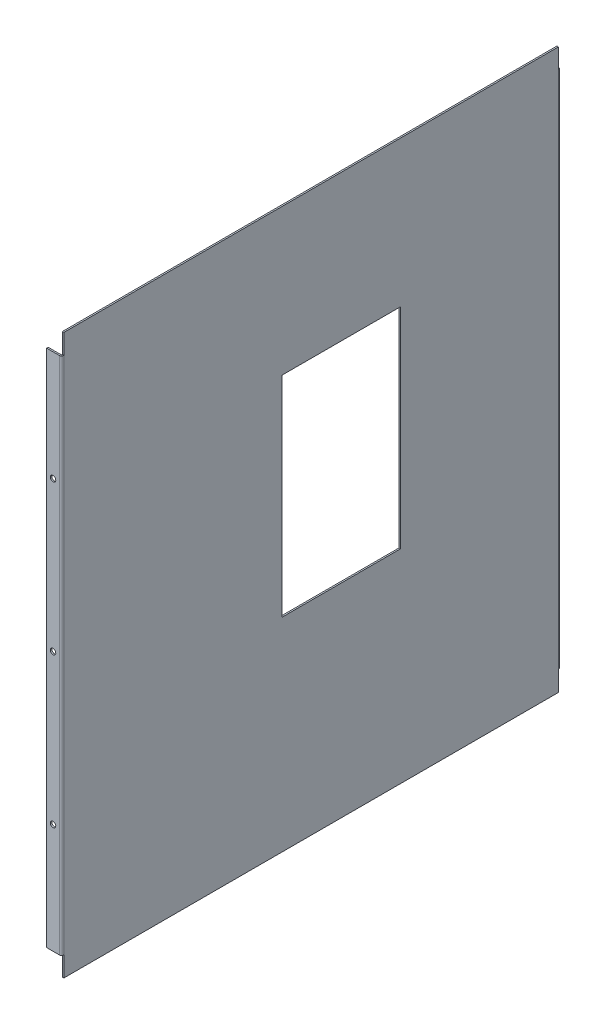
ISO-10303-21;
HEADER;
FILE_DESCRIPTION(('STEP AP214'),'2;1');
FILE_NAME('part.step','',(''),(''),'','','');
FILE_SCHEMA(('AUTOMOTIVE_DESIGN { 1 0 10303 214 1 1 1 1 }'));
ENDSEC;
DATA;
#1=APPLICATION_CONTEXT('core data for automotive mechanical design processes');
#2=APPLICATION_PROTOCOL_DEFINITION('international standard','automotive_design',2000,#1);
#3=PRODUCT_CONTEXT('',#1,'mechanical');
#4=PRODUCT('Part','Part','',(#3));
#5=PRODUCT_RELATED_PRODUCT_CATEGORY('part','',(#4));
#6=PRODUCT_DEFINITION_FORMATION('','',#4);
#7=PRODUCT_DEFINITION_CONTEXT('part definition',#1,'design');
#8=PRODUCT_DEFINITION('design','',#6,#7);
#9=PRODUCT_DEFINITION_SHAPE('','',#8);
#10=(LENGTH_UNIT() NAMED_UNIT(*) SI_UNIT(.MILLI.,.METRE.));
#11=(NAMED_UNIT(*) PLANE_ANGLE_UNIT() SI_UNIT($,.RADIAN.));
#12=(NAMED_UNIT(*) SI_UNIT($,.STERADIAN.) SOLID_ANGLE_UNIT());
#13=UNCERTAINTY_MEASURE_WITH_UNIT(LENGTH_MEASURE(1.E-05),#10,'distance_accuracy_value','');
#14=(GEOMETRIC_REPRESENTATION_CONTEXT(3) GLOBAL_UNCERTAINTY_ASSIGNED_CONTEXT((#13)) GLOBAL_UNIT_ASSIGNED_CONTEXT((#10,
#11,#12)) REPRESENTATION_CONTEXT('',''));
#15=CARTESIAN_POINT('',(0.,0.,0.));
#16=DIRECTION('',(0.,0.,1.));
#17=DIRECTION('',(1.,0.,0.));
#18=AXIS2_PLACEMENT_3D('',#15,#16,#17);
#19=CARTESIAN_POINT('',(0.,540.17,0.));
#20=DIRECTION('',(0.,1.,0.));
#21=DIRECTION('',(0.,0.,1.));
#22=AXIS2_PLACEMENT_3D('',#19,#20,#21);
#23=PLANE('',#22);
#24=DIRECTION('',(1.,0.,0.));
#25=VECTOR('',#24,1.);
#26=CARTESIAN_POINT('',(0.,540.17,1.5));
#27=LINE('',#26,#25);
#28=CARTESIAN_POINT('',(-13.5,540.17,1.49999999999995));
#29=VERTEX_POINT('',#28);
#30=CARTESIAN_POINT('',(-0.736599999999997,540.17,1.5));
#31=VERTEX_POINT('',#30);
#32=EDGE_CURVE('E238',#29,#31,#27,.T.);
#33=ORIENTED_EDGE('',*,*,#32,.T.);
#34=DIRECTION('',(0.,0.,-1.));
#35=VECTOR('',#34,1.);
#36=CARTESIAN_POINT('',(-0.736599999999997,540.17,1.5));
#37=LINE('',#36,#35);
#38=CARTESIAN_POINT('',(-0.736599999999997,540.17,0.));
#39=VERTEX_POINT('',#38);
#40=EDGE_CURVE('E13',#31,#39,#37,.T.);
#41=ORIENTED_EDGE('',*,*,#40,.T.);
#42=DIRECTION('',(1.,0.,0.));
#43=VECTOR('',#42,1.);
#44=CARTESIAN_POINT('',(0.,540.17,0.));
#45=LINE('',#44,#43);
#46=CARTESIAN_POINT('',(-13.5,540.17,0.));
#47=VERTEX_POINT('',#46);
#48=EDGE_CURVE('E96',#47,#39,#45,.T.);
#49=ORIENTED_EDGE('',*,*,#48,.F.);
#50=DIRECTION('',(0.,0.,-1.));
#51=VECTOR('',#50,1.);
#52=CARTESIAN_POINT('',(-13.5,540.17,0.));
#53=LINE('',#52,#51);
#54=EDGE_CURVE('E342',#29,#47,#53,.T.);
#55=ORIENTED_EDGE('',*,*,#54,.F.);
#56=EDGE_LOOP('',(#33,#41,#49,#55));
#57=FACE_BOUND('',#56,.T.);
#58=ADVANCED_FACE('F82',(#57),#23,.T.);
#59=CARTESIAN_POINT('',(0.,540.17,0.));
#60=DIRECTION('',(0.,-1.,0.));
#61=DIRECTION('',(0.,0.,-1.));
#62=AXIS2_PLACEMENT_3D('',#59,#60,#61);
#63=PLANE('',#62);
#64=DIRECTION('',(1.,0.,0.));
#65=VECTOR('',#64,1.);
#66=CARTESIAN_POINT('',(0.,540.17,500.));
#67=LINE('',#66,#65);
#68=CARTESIAN_POINT('',(-13.5,540.17,500.));
#69=VERTEX_POINT('',#68);
#70=CARTESIAN_POINT('',(-0.736599999999976,540.17,500.));
#71=VERTEX_POINT('',#70);
#72=EDGE_CURVE('E351',#69,#71,#67,.T.);
#73=ORIENTED_EDGE('',*,*,#72,.T.);
#74=DIRECTION('',(0.,0.,-1.));
#75=VECTOR('',#74,1.);
#76=CARTESIAN_POINT('',(-0.736599999999976,540.17,500.));
#77=LINE('',#76,#75);
#78=CARTESIAN_POINT('',(-0.736599999999976,540.17,498.5));
#79=VERTEX_POINT('',#78);
#80=EDGE_CURVE('E90',#71,#79,#77,.T.);
#81=ORIENTED_EDGE('',*,*,#80,.T.);
#82=DIRECTION('',(1.,0.,0.));
#83=VECTOR('',#82,1.);
#84=CARTESIAN_POINT('',(0.,540.17,498.5));
#85=LINE('',#84,#83);
#86=CARTESIAN_POINT('',(-13.5,540.17,498.5));
#87=VERTEX_POINT('',#86);
#88=EDGE_CURVE('E348',#87,#79,#85,.T.);
#89=ORIENTED_EDGE('',*,*,#88,.F.);
#90=DIRECTION('',(0.,0.,1.));
#91=VECTOR('',#90,1.);
#92=CARTESIAN_POINT('',(-13.5,540.17,500.));
#93=LINE('',#92,#91);
#94=EDGE_CURVE('E340',#87,#69,#93,.T.);
#95=ORIENTED_EDGE('',*,*,#94,.T.);
#96=EDGE_LOOP('',(#73,#81,#89,#95));
#97=FACE_BOUND('',#96,.T.);
#98=ADVANCED_FACE('F346',(#97),#63,.F.);
#99=CARTESIAN_POINT('',(-0.736599999999997,0.,2.2366));
#100=DIRECTION('',(0.,-1.,0.));
#101=DIRECTION('',(0.,0.,-1.));
#102=AXIS2_PLACEMENT_3D('',#99,#100,#101);
#103=CYLINDRICAL_SURFACE('',#102,2.2366);
#104=DIRECTION('',(0.,-1.,0.));
#105=VECTOR('',#104,1.);
#106=CARTESIAN_POINT('',(-0.736599999999997,0.,0.));
#107=LINE('',#106,#105);
#108=CARTESIAN_POINT('',(-0.736599999999997,20.,0.));
#109=VERTEX_POINT('',#108);
#110=EDGE_CURVE('E247',#39,#109,#107,.T.);
#111=ORIENTED_EDGE('',*,*,#110,.F.);
#112=CARTESIAN_POINT('',(-0.736599999999997,540.17,2.2366));
#113=DIRECTION('',(0.,1.,0.));
#114=DIRECTION('',(0.,0.,1.));
#115=AXIS2_PLACEMENT_3D('',#112,#113,#114);
#116=CIRCLE('',#115,2.2366);
#117=CARTESIAN_POINT('',(1.5,540.17,2.2366));
#118=VERTEX_POINT('',#117);
#119=EDGE_CURVE('E222',#39,#118,#116,.F.);
#120=ORIENTED_EDGE('',*,*,#119,.T.);
#121=DIRECTION('',(0.,-1.,0.));
#122=VECTOR('',#121,1.);
#123=CARTESIAN_POINT('',(1.5,0.,2.2366));
#124=LINE('',#123,#122);
#125=CARTESIAN_POINT('',(1.5,20.,2.2366));
#126=VERTEX_POINT('',#125);
#127=EDGE_CURVE('E245',#126,#118,#124,.F.);
#128=ORIENTED_EDGE('',*,*,#127,.F.);
#129=CARTESIAN_POINT('',(-0.736599999999997,20.,2.2366));
#130=DIRECTION('',(0.,1.,0.));
#131=DIRECTION('',(0.,0.,1.));
#132=AXIS2_PLACEMENT_3D('',#129,#130,#131);
#133=CIRCLE('',#132,2.2366);
#134=EDGE_CURVE('E396',#109,#126,#133,.F.);
#135=ORIENTED_EDGE('',*,*,#134,.F.);
#136=EDGE_LOOP('',(#111,#120,#128,#135));
#137=FACE_BOUND('',#136,.T.);
#138=ADVANCED_FACE('F243',(#137),#103,.T.);
#139=CARTESIAN_POINT('',(-0.736599999999997,0.,2.2366));
#140=DIRECTION('',(0.,-1.,0.));
#141=DIRECTION('',(0.,0.,-1.));
#142=AXIS2_PLACEMENT_3D('',#139,#140,#141);
#143=CYLINDRICAL_SURFACE('',#142,0.7366);
#144=CARTESIAN_POINT('',(-0.736599999999997,540.17,2.2366));
#145=DIRECTION('',(0.,1.,0.));
#146=DIRECTION('',(0.,0.,1.));
#147=AXIS2_PLACEMENT_3D('',#144,#145,#146);
#148=CIRCLE('',#147,0.7366);
#149=CARTESIAN_POINT('',(0.,540.17,2.2366));
#150=VERTEX_POINT('',#149);
#151=EDGE_CURVE('E224',#31,#150,#148,.F.);
#152=ORIENTED_EDGE('',*,*,#151,.F.);
#153=DIRECTION('',(0.,1.,0.));
#154=VECTOR('',#153,1.);
#155=CARTESIAN_POINT('',(-0.736599999999997,560.17,1.5));
#156=LINE('',#155,#154);
#157=CARTESIAN_POINT('',(-0.736599999999997,20.,1.5));
#158=VERTEX_POINT('',#157);
#159=EDGE_CURVE('E259',#31,#158,#156,.F.);
#160=ORIENTED_EDGE('',*,*,#159,.T.);
#161=CARTESIAN_POINT('',(-0.736599999999997,20.,2.2366));
#162=DIRECTION('',(0.,1.,0.));
#163=DIRECTION('',(0.,0.,1.));
#164=AXIS2_PLACEMENT_3D('',#161,#162,#163);
#165=CIRCLE('',#164,0.7366);
#166=CARTESIAN_POINT('',(0.,20.,2.2366));
#167=VERTEX_POINT('',#166);
#168=EDGE_CURVE('E393',#158,#167,#165,.F.);
#169=ORIENTED_EDGE('',*,*,#168,.T.);
#170=DIRECTION('',(0.,-1.,0.));
#171=VECTOR('',#170,1.);
#172=CARTESIAN_POINT('',(0.,0.,2.2366));
#173=LINE('',#172,#171);
#174=EDGE_CURVE('E255',#167,#150,#173,.F.);
#175=ORIENTED_EDGE('',*,*,#174,.T.);
#176=EDGE_LOOP('',(#152,#160,#169,#175));
#177=FACE_BOUND('',#176,.T.);
#178=ADVANCED_FACE('F406',(#177),#143,.F.);
#179=CARTESIAN_POINT('',(0.,0.,0.));
#180=DIRECTION('',(0.,0.,-1.));
#181=DIRECTION('',(-1.,0.,0.));
#182=AXIS2_PLACEMENT_3D('',#179,#180,#181);
#183=PLANE('',#182);
#184=CARTESIAN_POINT('',(-7.1183,280.085,0.));
#185=DIRECTION('',(0.,0.,-1.));
#186=DIRECTION('',(-1.,0.,0.));
#187=AXIS2_PLACEMENT_3D('',#184,#185,#186);
#188=CIRCLE('',#187,2.75);
#189=CARTESIAN_POINT('',(-9.8683,280.085,0.));
#190=VERTEX_POINT('',#189);
#191=EDGE_CURVE('E907',#190,#190,#188,.T.);
#192=ORIENTED_EDGE('',*,*,#191,.F.);
#193=EDGE_LOOP('',(#192));
#194=FACE_BOUND('',#193,.T.);
#195=CARTESIAN_POINT('',(-7.11829999999995,130.085,0.));
#196=DIRECTION('',(0.,0.,-1.));
#197=DIRECTION('',(-1.,0.,0.));
#198=AXIS2_PLACEMENT_3D('',#195,#196,#197);
#199=CIRCLE('',#198,2.75);
#200=CARTESIAN_POINT('',(-9.86829999999995,130.085,0.));
#201=VERTEX_POINT('',#200);
#202=EDGE_CURVE('E902',#201,#201,#199,.T.);
#203=ORIENTED_EDGE('',*,*,#202,.F.);
#204=EDGE_LOOP('',(#203));
#205=FACE_BOUND('',#204,.T.);
#206=CARTESIAN_POINT('',(-7.11829999999999,430.085,0.));
#207=DIRECTION('',(0.,0.,-1.));
#208=DIRECTION('',(-1.,0.,0.));
#209=AXIS2_PLACEMENT_3D('',#206,#207,#208);
#210=CIRCLE('',#209,2.75);
#211=CARTESIAN_POINT('',(-9.86829999999999,430.085,0.));
#212=VERTEX_POINT('',#211);
#213=EDGE_CURVE('E228',#212,#212,#210,.T.);
#214=ORIENTED_EDGE('',*,*,#213,.F.);
#215=EDGE_LOOP('',(#214));
#216=FACE_BOUND('',#215,.T.);
#217=DIRECTION('',(0.,-1.,0.));
#218=VECTOR('',#217,1.);
#219=CARTESIAN_POINT('',(-13.5,0.,0.));
#220=LINE('',#219,#218);
#221=CARTESIAN_POINT('',(-13.5,20.,0.));
#222=VERTEX_POINT('',#221);
#223=EDGE_CURVE('E398',#47,#222,#220,.T.);
#224=ORIENTED_EDGE('',*,*,#223,.F.);
#225=ORIENTED_EDGE('',*,*,#48,.T.);
#226=ORIENTED_EDGE('',*,*,#110,.T.);
#227=DIRECTION('',(1.,0.,0.));
#228=VECTOR('',#227,1.);
#229=CARTESIAN_POINT('',(0.,20.,0.));
#230=LINE('',#229,#228);
#231=EDGE_CURVE('E390',#222,#109,#230,.T.);
#232=ORIENTED_EDGE('',*,*,#231,.F.);
#233=EDGE_LOOP('',(#224,#225,#226,#232));
#234=FACE_BOUND('',#233,.T.);
#235=ADVANCED_FACE('F425',(#194,#205,#216,#234),#183,.T.);
#236=CARTESIAN_POINT('',(0.,0.,1.5));
#237=DIRECTION('',(0.,0.,-1.));
#238=DIRECTION('',(-1.,0.,0.));
#239=AXIS2_PLACEMENT_3D('',#236,#237,#238);
#240=PLANE('',#239);
#241=CARTESIAN_POINT('',(-7.1183,280.085,1.5));
#242=DIRECTION('',(0.,0.,1.));
#243=DIRECTION('',(1.,0.,0.));
#244=AXIS2_PLACEMENT_3D('',#241,#242,#243);
#245=CIRCLE('',#244,2.75);
#246=CARTESIAN_POINT('',(-4.3683,280.085,1.5));
#247=VERTEX_POINT('',#246);
#248=EDGE_CURVE('E899',#247,#247,#245,.T.);
#249=ORIENTED_EDGE('',*,*,#248,.F.);
#250=EDGE_LOOP('',(#249));
#251=FACE_BOUND('',#250,.T.);
#252=CARTESIAN_POINT('',(-7.11829999999995,130.085,1.5));
#253=DIRECTION('',(0.,0.,1.));
#254=DIRECTION('',(-1.,0.,0.));
#255=AXIS2_PLACEMENT_3D('',#252,#253,#254);
#256=CIRCLE('',#255,2.75);
#257=CARTESIAN_POINT('',(-9.86829999999995,130.085,1.5));
#258=VERTEX_POINT('',#257);
#259=EDGE_CURVE('E898',#258,#258,#256,.T.);
#260=ORIENTED_EDGE('',*,*,#259,.F.);
#261=EDGE_LOOP('',(#260));
#262=FACE_BOUND('',#261,.T.);
#263=CARTESIAN_POINT('',(-7.11829999999999,430.085,1.5));
#264=DIRECTION('',(0.,0.,1.));
#265=DIRECTION('',(1.,0.,0.));
#266=AXIS2_PLACEMENT_3D('',#263,#264,#265);
#267=CIRCLE('',#266,2.75);
#268=CARTESIAN_POINT('',(-4.36829999999999,430.085,1.5));
#269=VERTEX_POINT('',#268);
#270=EDGE_CURVE('E910',#269,#269,#267,.T.);
#271=ORIENTED_EDGE('',*,*,#270,.F.);
#272=EDGE_LOOP('',(#271));
#273=FACE_BOUND('',#272,.T.);
#274=ORIENTED_EDGE('',*,*,#32,.F.);
#275=DIRECTION('',(0.,1.,0.));
#276=VECTOR('',#275,1.);
#277=CARTESIAN_POINT('',(-13.5,0.,1.49999999999995));
#278=LINE('',#277,#276);
#279=CARTESIAN_POINT('',(-13.5,20.,1.49999999999995));
#280=VERTEX_POINT('',#279);
#281=EDGE_CURVE('E400',#29,#280,#278,.F.);
#282=ORIENTED_EDGE('',*,*,#281,.T.);
#283=DIRECTION('',(1.,0.,0.));
#284=VECTOR('',#283,1.);
#285=CARTESIAN_POINT('',(0.,20.,1.5));
#286=LINE('',#285,#284);
#287=EDGE_CURVE('E387',#280,#158,#286,.T.);
#288=ORIENTED_EDGE('',*,*,#287,.T.);
#289=ORIENTED_EDGE('',*,*,#159,.F.);
#290=EDGE_LOOP('',(#274,#282,#288,#289));
#291=FACE_BOUND('',#290,.T.);
#292=ADVANCED_FACE('F419',(#251,#262,#273,#291),#240,.F.);
#293=CARTESIAN_POINT('',(-13.5,0.,0.));
#294=DIRECTION('',(-1.,0.,0.));
#295=DIRECTION('',(0.,0.,1.));
#296=AXIS2_PLACEMENT_3D('',#293,#294,#295);
#297=PLANE('',#296);
#298=ORIENTED_EDGE('',*,*,#281,.F.);
#299=ORIENTED_EDGE('',*,*,#54,.T.);
#300=ORIENTED_EDGE('',*,*,#223,.T.);
#301=DIRECTION('',(0.,0.,-1.));
#302=VECTOR('',#301,1.);
#303=CARTESIAN_POINT('',(-13.5,20.,0.));
#304=LINE('',#303,#302);
#305=EDGE_CURVE('E330',#280,#222,#304,.T.);
#306=ORIENTED_EDGE('',*,*,#305,.F.);
#307=EDGE_LOOP('',(#298,#299,#300,#306));
#308=FACE_BOUND('',#307,.T.);
#309=ADVANCED_FACE('F423',(#308),#297,.T.);
#310=CARTESIAN_POINT('',(0.,20.,0.));
#311=DIRECTION('',(0.,-1.,0.));
#312=DIRECTION('',(0.,0.,-1.));
#313=AXIS2_PLACEMENT_3D('',#310,#311,#312);
#314=PLANE('',#313);
#315=DIRECTION('',(1.,0.,0.));
#316=VECTOR('',#315,1.);
#317=CARTESIAN_POINT('',(0.,20.,498.5));
#318=LINE('',#317,#316);
#319=CARTESIAN_POINT('',(-13.5,20.,498.5));
#320=VERTEX_POINT('',#319);
#321=CARTESIAN_POINT('',(-0.736599999999976,20.,498.5));
#322=VERTEX_POINT('',#321);
#323=EDGE_CURVE('E381',#320,#322,#318,.T.);
#324=ORIENTED_EDGE('',*,*,#323,.T.);
#325=DIRECTION('',(0.,0.,1.));
#326=VECTOR('',#325,1.);
#327=CARTESIAN_POINT('',(-0.736599999999976,20.,498.5));
#328=LINE('',#327,#326);
#329=CARTESIAN_POINT('',(-0.736599999999976,20.,500.));
#330=VERTEX_POINT('',#329);
#331=EDGE_CURVE('E338',#322,#330,#328,.T.);
#332=ORIENTED_EDGE('',*,*,#331,.T.);
#333=DIRECTION('',(1.,0.,0.));
#334=VECTOR('',#333,1.);
#335=CARTESIAN_POINT('',(0.,20.,500.));
#336=LINE('',#335,#334);
#337=CARTESIAN_POINT('',(-13.5,20.,500.));
#338=VERTEX_POINT('',#337);
#339=EDGE_CURVE('E104',#338,#330,#336,.T.);
#340=ORIENTED_EDGE('',*,*,#339,.F.);
#341=DIRECTION('',(0.,0.,1.));
#342=VECTOR('',#341,1.);
#343=CARTESIAN_POINT('',(-13.5,20.,500.));
#344=LINE('',#343,#342);
#345=EDGE_CURVE('E333',#320,#338,#344,.T.);
#346=ORIENTED_EDGE('',*,*,#345,.F.);
#347=EDGE_LOOP('',(#324,#332,#340,#346));
#348=FACE_BOUND('',#347,.T.);
#349=ADVANCED_FACE('F438',(#348),#314,.T.);
#350=CARTESIAN_POINT('',(0.,20.,0.));
#351=DIRECTION('',(0.,1.,0.));
#352=DIRECTION('',(0.,0.,1.));
#353=AXIS2_PLACEMENT_3D('',#350,#351,#352);
#354=PLANE('',#353);
#355=ORIENTED_EDGE('',*,*,#231,.T.);
#356=DIRECTION('',(0.,0.,1.));
#357=VECTOR('',#356,1.);
#358=CARTESIAN_POINT('',(-0.736599999999997,20.,0.));
#359=LINE('',#358,#357);
#360=EDGE_CURVE('E335',#109,#158,#359,.T.);
#361=ORIENTED_EDGE('',*,*,#360,.T.);
#362=ORIENTED_EDGE('',*,*,#287,.F.);
#363=ORIENTED_EDGE('',*,*,#305,.T.);
#364=EDGE_LOOP('',(#355,#361,#362,#363));
#365=FACE_BOUND('',#364,.T.);
#366=ADVANCED_FACE('F414',(#365),#354,.F.);
#367=CARTESIAN_POINT('',(-0.736599999999976,560.17,497.7634));
#368=DIRECTION('',(0.,1.,0.));
#369=DIRECTION('',(0.,0.,1.));
#370=AXIS2_PLACEMENT_3D('',#367,#368,#369);
#371=CYLINDRICAL_SURFACE('',#370,2.23659999999998);
#372=CARTESIAN_POINT('',(-0.736599999999976,540.17,497.7634));
#373=DIRECTION('',(0.,-1.,0.));
#374=DIRECTION('',(0.,0.,-1.));
#375=AXIS2_PLACEMENT_3D('',#372,#373,#374);
#376=CIRCLE('',#375,2.23659999999998);
#377=CARTESIAN_POINT('',(1.5,540.17,497.7634));
#378=VERTEX_POINT('',#377);
#379=EDGE_CURVE('E361',#71,#378,#376,.F.);
#380=ORIENTED_EDGE('',*,*,#379,.F.);
#381=DIRECTION('',(0.,1.,0.));
#382=VECTOR('',#381,1.);
#383=CARTESIAN_POINT('',(-0.736599999999976,0.,500.));
#384=LINE('',#383,#382);
#385=EDGE_CURVE('E273',#330,#71,#384,.T.);
#386=ORIENTED_EDGE('',*,*,#385,.F.);
#387=CARTESIAN_POINT('',(-0.736599999999976,20.,497.7634));
#388=DIRECTION('',(0.,-1.,0.));
#389=DIRECTION('',(0.,0.,-1.));
#390=AXIS2_PLACEMENT_3D('',#387,#388,#389);
#391=CIRCLE('',#390,2.23659999999998);
#392=CARTESIAN_POINT('',(1.5,20.,497.7634));
#393=VERTEX_POINT('',#392);
#394=EDGE_CURVE('E376',#330,#393,#391,.F.);
#395=ORIENTED_EDGE('',*,*,#394,.T.);
#396=DIRECTION('',(0.,1.,0.));
#397=VECTOR('',#396,1.);
#398=CARTESIAN_POINT('',(1.5,560.17,497.7634));
#399=LINE('',#398,#397);
#400=EDGE_CURVE('E282',#378,#393,#399,.F.);
#401=ORIENTED_EDGE('',*,*,#400,.F.);
#402=EDGE_LOOP('',(#380,#386,#395,#401));
#403=FACE_BOUND('',#402,.T.);
#404=ADVANCED_FACE('F447',(#403),#371,.T.);
#405=CARTESIAN_POINT('',(-0.736599999999976,560.17,497.7634));
#406=DIRECTION('',(0.,1.,0.));
#407=DIRECTION('',(0.,0.,1.));
#408=AXIS2_PLACEMENT_3D('',#405,#406,#407);
#409=CYLINDRICAL_SURFACE('',#408,0.736599999999976);
#410=DIRECTION('',(0.,-1.,0.));
#411=VECTOR('',#410,1.);
#412=CARTESIAN_POINT('',(-0.736599999999976,0.,498.5));
#413=LINE('',#412,#411);
#414=EDGE_CURVE('E263',#322,#79,#413,.F.);
#415=ORIENTED_EDGE('',*,*,#414,.T.);
#416=CARTESIAN_POINT('',(-0.736599999999976,540.17,497.7634));
#417=DIRECTION('',(0.,-1.,0.));
#418=DIRECTION('',(0.,0.,-1.));
#419=AXIS2_PLACEMENT_3D('',#416,#417,#418);
#420=CIRCLE('',#419,0.736599999999976);
#421=CARTESIAN_POINT('',(0.,540.17,497.7634));
#422=VERTEX_POINT('',#421);
#423=EDGE_CURVE('E356',#79,#422,#420,.F.);
#424=ORIENTED_EDGE('',*,*,#423,.T.);
#425=DIRECTION('',(0.,1.,0.));
#426=VECTOR('',#425,1.);
#427=CARTESIAN_POINT('',(0.,560.17,497.7634));
#428=LINE('',#427,#426);
#429=CARTESIAN_POINT('',(0.,20.,497.7634));
#430=VERTEX_POINT('',#429);
#431=EDGE_CURVE('E285',#422,#430,#428,.F.);
#432=ORIENTED_EDGE('',*,*,#431,.T.);
#433=CARTESIAN_POINT('',(-0.736599999999976,20.,497.7634));
#434=DIRECTION('',(0.,-1.,0.));
#435=DIRECTION('',(0.,0.,-1.));
#436=AXIS2_PLACEMENT_3D('',#433,#434,#435);
#437=CIRCLE('',#436,0.736599999999976);
#438=EDGE_CURVE('E372',#322,#430,#437,.F.);
#439=ORIENTED_EDGE('',*,*,#438,.F.);
#440=EDGE_LOOP('',(#415,#424,#432,#439));
#441=FACE_BOUND('',#440,.T.);
#442=ADVANCED_FACE('F370',(#441),#409,.F.);
#443=CARTESIAN_POINT('',(0.,0.,500.));
#444=DIRECTION('',(0.,0.,1.));
#445=DIRECTION('',(1.,0.,0.));
#446=AXIS2_PLACEMENT_3D('',#443,#444,#445);
#447=PLANE('',#446);
#448=CARTESIAN_POINT('',(-7.1183,280.085,500.));
#449=DIRECTION('',(0.,0.,1.));
#450=DIRECTION('',(1.,0.,0.));
#451=AXIS2_PLACEMENT_3D('',#448,#449,#450);
#452=CIRCLE('',#451,2.74999999999999);
#453=CARTESIAN_POINT('',(-4.36830000000001,280.085,500.));
#454=VERTEX_POINT('',#453);
#455=EDGE_CURVE('E879',#454,#454,#452,.T.);
#456=ORIENTED_EDGE('',*,*,#455,.F.);
#457=EDGE_LOOP('',(#456));
#458=FACE_BOUND('',#457,.T.);
#459=CARTESIAN_POINT('',(-7.11829999999995,130.085,500.));
#460=DIRECTION('',(0.,0.,1.));
#461=DIRECTION('',(1.,0.,0.));
#462=AXIS2_PLACEMENT_3D('',#459,#460,#461);
#463=CIRCLE('',#462,2.75);
#464=CARTESIAN_POINT('',(-4.36829999999995,130.085,500.));
#465=VERTEX_POINT('',#464);
#466=EDGE_CURVE('E883',#465,#465,#463,.T.);
#467=ORIENTED_EDGE('',*,*,#466,.F.);
#468=EDGE_LOOP('',(#467));
#469=FACE_BOUND('',#468,.T.);
#470=CARTESIAN_POINT('',(-7.11829999999999,430.085,500.));
#471=DIRECTION('',(0.,0.,1.));
#472=DIRECTION('',(1.,0.,0.));
#473=AXIS2_PLACEMENT_3D('',#470,#471,#472);
#474=CIRCLE('',#473,2.75000000000001);
#475=CARTESIAN_POINT('',(-4.36829999999997,430.085,500.));
#476=VERTEX_POINT('',#475);
#477=EDGE_CURVE('E895',#476,#476,#474,.T.);
#478=ORIENTED_EDGE('',*,*,#477,.F.);
#479=EDGE_LOOP('',(#478));
#480=FACE_BOUND('',#479,.T.);
#481=ORIENTED_EDGE('',*,*,#72,.F.);
#482=DIRECTION('',(0.,1.,0.));
#483=VECTOR('',#482,1.);
#484=CARTESIAN_POINT('',(-13.5,560.17,500.));
#485=LINE('',#484,#483);
#486=EDGE_CURVE('E266',#338,#69,#485,.T.);
#487=ORIENTED_EDGE('',*,*,#486,.F.);
#488=ORIENTED_EDGE('',*,*,#339,.T.);
#489=ORIENTED_EDGE('',*,*,#385,.T.);
#490=EDGE_LOOP('',(#481,#487,#488,#489));
#491=FACE_BOUND('',#490,.T.);
#492=ADVANCED_FACE('F444',(#458,#469,#480,#491),#447,.T.);
#493=CARTESIAN_POINT('',(0.,0.,498.5));
#494=DIRECTION('',(0.,0.,1.));
#495=DIRECTION('',(1.,0.,0.));
#496=AXIS2_PLACEMENT_3D('',#493,#494,#495);
#497=PLANE('',#496);
#498=CARTESIAN_POINT('',(-7.1183,280.085,498.5));
#499=DIRECTION('',(0.,0.,-1.));
#500=DIRECTION('',(-1.,0.,0.));
#501=AXIS2_PLACEMENT_3D('',#498,#499,#500);
#502=CIRCLE('',#501,2.74999999999999);
#503=CARTESIAN_POINT('',(-9.86829999999999,280.085,498.5));
#504=VERTEX_POINT('',#503);
#505=EDGE_CURVE('E882',#504,#504,#502,.T.);
#506=ORIENTED_EDGE('',*,*,#505,.F.);
#507=EDGE_LOOP('',(#506));
#508=FACE_BOUND('',#507,.T.);
#509=CARTESIAN_POINT('',(-7.11829999999995,130.085,498.5));
#510=DIRECTION('',(0.,0.,-1.));
#511=DIRECTION('',(-1.,0.,0.));
#512=AXIS2_PLACEMENT_3D('',#509,#510,#511);
#513=CIRCLE('',#512,2.75);
#514=CARTESIAN_POINT('',(-9.86829999999995,130.085,498.5));
#515=VERTEX_POINT('',#514);
#516=EDGE_CURVE('E884',#515,#515,#513,.T.);
#517=ORIENTED_EDGE('',*,*,#516,.F.);
#518=EDGE_LOOP('',(#517));
#519=FACE_BOUND('',#518,.T.);
#520=CARTESIAN_POINT('',(-7.11829999999999,430.085,498.5));
#521=DIRECTION('',(0.,0.,-1.));
#522=DIRECTION('',(-1.,0.,0.));
#523=AXIS2_PLACEMENT_3D('',#520,#521,#522);
#524=CIRCLE('',#523,2.75000000000001);
#525=CARTESIAN_POINT('',(-9.8683,430.085,498.5));
#526=VERTEX_POINT('',#525);
#527=EDGE_CURVE('E892',#526,#526,#524,.T.);
#528=ORIENTED_EDGE('',*,*,#527,.F.);
#529=EDGE_LOOP('',(#528));
#530=FACE_BOUND('',#529,.T.);
#531=DIRECTION('',(0.,-1.,0.));
#532=VECTOR('',#531,1.);
#533=CARTESIAN_POINT('',(-13.5,0.,498.5));
#534=LINE('',#533,#532);
#535=EDGE_CURVE('E270',#320,#87,#534,.F.);
#536=ORIENTED_EDGE('',*,*,#535,.T.);
#537=ORIENTED_EDGE('',*,*,#88,.T.);
#538=ORIENTED_EDGE('',*,*,#414,.F.);
#539=ORIENTED_EDGE('',*,*,#323,.F.);
#540=EDGE_LOOP('',(#536,#537,#538,#539));
#541=FACE_BOUND('',#540,.T.);
#542=ADVANCED_FACE('F365',(#508,#519,#530,#541),#497,.F.);
#543=CARTESIAN_POINT('',(-13.5,560.17,500.));
#544=DIRECTION('',(-1.,0.,0.));
#545=DIRECTION('',(0.,0.,1.));
#546=AXIS2_PLACEMENT_3D('',#543,#544,#545);
#547=PLANE('',#546);
#548=ORIENTED_EDGE('',*,*,#94,.F.);
#549=ORIENTED_EDGE('',*,*,#535,.F.);
#550=ORIENTED_EDGE('',*,*,#345,.T.);
#551=ORIENTED_EDGE('',*,*,#486,.T.);
#552=EDGE_LOOP('',(#548,#549,#550,#551));
#553=FACE_BOUND('',#552,.T.);
#554=ADVANCED_FACE('F441',(#553),#547,.T.);
#555=CARTESIAN_POINT('',(1.5,0.,500.));
#556=DIRECTION('',(-1.,0.,0.));
#557=DIRECTION('',(0.,0.,1.));
#558=AXIS2_PLACEMENT_3D('',#555,#556,#557);
#559=PLANE('',#558);
#560=DIRECTION('',(0.,0.,1.));
#561=VECTOR('',#560,1.);
#562=CARTESIAN_POINT('',(1.5,413.76939382341,405.034676754157));
#563=LINE('',#562,#561);
#564=CARTESIAN_POINT('',(1.5,413.76939382341,160.464305355548));
#565=VERTEX_POINT('',#564);
#566=CARTESIAN_POINT('',(1.5,413.76939382341,279.034676754157));
#567=VERTEX_POINT('',#566);
#568=EDGE_CURVE('E315',#565,#567,#563,.T.);
#569=ORIENTED_EDGE('',*,*,#568,.F.);
#570=DIRECTION('',(0.,1.,0.));
#571=VECTOR('',#570,1.);
#572=CARTESIAN_POINT('',(1.5,413.76939382341,160.464305355548));
#573=LINE('',#572,#571);
#574=CARTESIAN_POINT('',(1.5,203.77060617659,160.464305355548));
#575=VERTEX_POINT('',#574);
#576=EDGE_CURVE('E288',#575,#565,#573,.T.);
#577=ORIENTED_EDGE('',*,*,#576,.F.);
#578=DIRECTION('',(0.,0.,-1.));
#579=VECTOR('',#578,1.);
#580=CARTESIAN_POINT('',(1.5,203.77060617659,405.034676754157));
#581=LINE('',#580,#579);
#582=CARTESIAN_POINT('',(1.5,203.77060617659,279.034676754157));
#583=VERTEX_POINT('',#582);
#584=EDGE_CURVE('E310',#583,#575,#581,.T.);
#585=ORIENTED_EDGE('',*,*,#584,.F.);
#586=DIRECTION('',(0.,-1.,0.));
#587=VECTOR('',#586,1.);
#588=CARTESIAN_POINT('',(1.5,413.76939382341,279.034676754157));
#589=LINE('',#588,#587);
#590=EDGE_CURVE('E298',#567,#583,#589,.T.);
#591=ORIENTED_EDGE('',*,*,#590,.F.);
#592=EDGE_LOOP('',(#569,#577,#585,#591));
#593=FACE_BOUND('',#592,.T.);
#594=CARTESIAN_POINT('',(1.5,0.,2.2366));
#595=VERTEX_POINT('',#594);
#596=EDGE_CURVE('E251',#595,#126,#124,.F.);
#597=ORIENTED_EDGE('',*,*,#596,.T.);
#598=ORIENTED_EDGE('',*,*,#127,.T.);
#599=DIRECTION('',(0.,1.,0.));
#600=VECTOR('',#599,1.);
#601=CARTESIAN_POINT('',(1.5,540.17,2.2366));
#602=LINE('',#601,#600);
#603=CARTESIAN_POINT('',(1.5,560.17,2.2366));
#604=VERTEX_POINT('',#603);
#605=EDGE_CURVE('E227',#118,#604,#602,.T.);
#606=ORIENTED_EDGE('',*,*,#605,.T.);
#607=DIRECTION('',(0.,0.,-1.));
#608=VECTOR('',#607,1.);
#609=CARTESIAN_POINT('',(1.5,560.17,500.));
#610=LINE('',#609,#608);
#611=CARTESIAN_POINT('',(1.5,560.17,497.7634));
#612=VERTEX_POINT('',#611);
#613=EDGE_CURVE('E328',#612,#604,#610,.T.);
#614=ORIENTED_EDGE('',*,*,#613,.F.);
#615=EDGE_CURVE('E278',#612,#378,#399,.F.);
#616=ORIENTED_EDGE('',*,*,#615,.T.);
#617=ORIENTED_EDGE('',*,*,#400,.T.);
#618=DIRECTION('',(0.,-1.,0.));
#619=VECTOR('',#618,1.);
#620=CARTESIAN_POINT('',(1.5,20.,497.7634));
#621=LINE('',#620,#619);
#622=CARTESIAN_POINT('',(1.5,0.,497.7634));
#623=VERTEX_POINT('',#622);
#624=EDGE_CURVE('E435',#393,#623,#621,.T.);
#625=ORIENTED_EDGE('',*,*,#624,.T.);
#626=DIRECTION('',(0.,0.,-1.));
#627=VECTOR('',#626,1.);
#628=CARTESIAN_POINT('',(1.5,0.,500.));
#629=LINE('',#628,#627);
#630=EDGE_CURVE('E320',#623,#595,#629,.T.);
#631=ORIENTED_EDGE('',*,*,#630,.T.);
#632=EDGE_LOOP('',(#597,#598,#606,#614,#616,#617,#625,#631));
#633=FACE_BOUND('',#632,.T.);
#634=ADVANCED_FACE('F84',(#593,#633),#559,.F.);
#635=CARTESIAN_POINT('',(0.,0.,500.));
#636=DIRECTION('',(-1.,0.,0.));
#637=DIRECTION('',(0.,0.,1.));
#638=AXIS2_PLACEMENT_3D('',#635,#636,#637);
#639=PLANE('',#638);
#640=DIRECTION('',(0.,0.,-1.));
#641=VECTOR('',#640,1.);
#642=CARTESIAN_POINT('',(0.,413.76939382341,405.034676754157));
#643=LINE('',#642,#641);
#644=CARTESIAN_POINT('',(0.,413.76939382341,279.034676754157));
#645=VERTEX_POINT('',#644);
#646=CARTESIAN_POINT('',(0.,413.76939382341,160.464305355548));
#647=VERTEX_POINT('',#646);
#648=EDGE_CURVE('E317',#645,#647,#643,.T.);
#649=ORIENTED_EDGE('',*,*,#648,.F.);
#650=DIRECTION('',(0.,1.,0.));
#651=VECTOR('',#650,1.);
#652=CARTESIAN_POINT('',(0.,413.76939382341,279.034676754157));
#653=LINE('',#652,#651);
#654=CARTESIAN_POINT('',(0.,203.77060617659,279.034676754157));
#655=VERTEX_POINT('',#654);
#656=EDGE_CURVE('E304',#655,#645,#653,.T.);
#657=ORIENTED_EDGE('',*,*,#656,.F.);
#658=DIRECTION('',(0.,0.,1.));
#659=VECTOR('',#658,1.);
#660=CARTESIAN_POINT('',(0.,203.77060617659,405.034676754157));
#661=LINE('',#660,#659);
#662=CARTESIAN_POINT('',(0.,203.77060617659,160.464305355548));
#663=VERTEX_POINT('',#662);
#664=EDGE_CURVE('E313',#663,#655,#661,.T.);
#665=ORIENTED_EDGE('',*,*,#664,.F.);
#666=DIRECTION('',(0.,-1.,0.));
#667=VECTOR('',#666,1.);
#668=CARTESIAN_POINT('',(0.,413.76939382341,160.464305355548));
#669=LINE('',#668,#667);
#670=EDGE_CURVE('E294',#647,#663,#669,.T.);
#671=ORIENTED_EDGE('',*,*,#670,.F.);
#672=EDGE_LOOP('',(#649,#657,#665,#671));
#673=FACE_BOUND('',#672,.T.);
#674=DIRECTION('',(0.,0.,-1.));
#675=VECTOR('',#674,1.);
#676=CARTESIAN_POINT('',(0.,560.17,500.));
#677=LINE('',#676,#675);
#678=CARTESIAN_POINT('',(0.,560.17,497.7634));
#679=VERTEX_POINT('',#678);
#680=CARTESIAN_POINT('',(0.,560.17,2.2366));
#681=VERTEX_POINT('',#680);
#682=EDGE_CURVE('E325',#679,#681,#677,.T.);
#683=ORIENTED_EDGE('',*,*,#682,.T.);
#684=EDGE_CURVE('E257',#150,#681,#173,.F.);
#685=ORIENTED_EDGE('',*,*,#684,.F.);
#686=ORIENTED_EDGE('',*,*,#174,.F.);
#687=CARTESIAN_POINT('',(0.,0.,2.2366));
#688=VERTEX_POINT('',#687);
#689=EDGE_CURVE('E252',#688,#167,#173,.F.);
#690=ORIENTED_EDGE('',*,*,#689,.F.);
#691=DIRECTION('',(0.,0.,-1.));
#692=VECTOR('',#691,1.);
#693=CARTESIAN_POINT('',(0.,0.,500.));
#694=LINE('',#693,#692);
#695=CARTESIAN_POINT('',(0.,0.,497.7634));
#696=VERTEX_POINT('',#695);
#697=EDGE_CURVE('E322',#696,#688,#694,.T.);
#698=ORIENTED_EDGE('',*,*,#697,.F.);
#699=EDGE_CURVE('E269',#430,#696,#428,.F.);
#700=ORIENTED_EDGE('',*,*,#699,.F.);
#701=ORIENTED_EDGE('',*,*,#431,.F.);
#702=EDGE_CURVE('E283',#679,#422,#428,.F.);
#703=ORIENTED_EDGE('',*,*,#702,.F.);
#704=EDGE_LOOP('',(#683,#685,#686,#690,#698,#700,#701,#703));
#705=FACE_BOUND('',#704,.T.);
#706=ADVANCED_FACE('F454',(#673,#705),#639,.T.);
#707=CARTESIAN_POINT('',(1.5,0.,500.));
#708=DIRECTION('',(0.,-1.,0.));
#709=DIRECTION('',(0.,0.,-1.));
#710=AXIS2_PLACEMENT_3D('',#707,#708,#709);
#711=PLANE('',#710);
#712=ORIENTED_EDGE('',*,*,#697,.T.);
#713=DIRECTION('',(1.,0.,0.));
#714=VECTOR('',#713,1.);
#715=CARTESIAN_POINT('',(0.,0.,2.2366));
#716=LINE('',#715,#714);
#717=EDGE_CURVE('E254',#688,#595,#716,.T.);
#718=ORIENTED_EDGE('',*,*,#717,.T.);
#719=ORIENTED_EDGE('',*,*,#630,.F.);
#720=DIRECTION('',(1.,0.,0.));
#721=VECTOR('',#720,1.);
#722=CARTESIAN_POINT('',(0.,0.,497.7634));
#723=LINE('',#722,#721);
#724=EDGE_CURVE('E286',#696,#623,#723,.T.);
#725=ORIENTED_EDGE('',*,*,#724,.F.);
#726=EDGE_LOOP('',(#712,#718,#719,#725));
#727=FACE_BOUND('',#726,.T.);
#728=ADVANCED_FACE('F466',(#727),#711,.T.);
#729=CARTESIAN_POINT('',(0.,560.17,500.));
#730=DIRECTION('',(0.,1.,0.));
#731=DIRECTION('',(0.,0.,1.));
#732=AXIS2_PLACEMENT_3D('',#729,#730,#731);
#733=PLANE('',#732);
#734=DIRECTION('',(1.,0.,0.));
#735=VECTOR('',#734,1.);
#736=CARTESIAN_POINT('',(0.,560.17,2.2366));
#737=LINE('',#736,#735);
#738=EDGE_CURVE('E233',#681,#604,#737,.T.);
#739=ORIENTED_EDGE('',*,*,#738,.F.);
#740=ORIENTED_EDGE('',*,*,#682,.F.);
#741=DIRECTION('',(1.,0.,0.));
#742=VECTOR('',#741,1.);
#743=CARTESIAN_POINT('',(0.,560.17,497.7634));
#744=LINE('',#743,#742);
#745=EDGE_CURVE('E281',#679,#612,#744,.T.);
#746=ORIENTED_EDGE('',*,*,#745,.T.);
#747=ORIENTED_EDGE('',*,*,#613,.T.);
#748=EDGE_LOOP('',(#739,#740,#746,#747));
#749=FACE_BOUND('',#748,.T.);
#750=ADVANCED_FACE('F457',(#749),#733,.T.);
#751=CARTESIAN_POINT('',(0.,413.76939382341,0.));
#752=DIRECTION('',(0.,1.,0.));
#753=DIRECTION('',(0.,0.,1.));
#754=AXIS2_PLACEMENT_3D('',#751,#752,#753);
#755=PLANE('',#754);
#756=DIRECTION('',(-1.,0.,0.));
#757=VECTOR('',#756,1.);
#758=CARTESIAN_POINT('',(1.5,413.76939382341,160.464305355548));
#759=LINE('',#758,#757);
#760=EDGE_CURVE('E292',#565,#647,#759,.T.);
#761=ORIENTED_EDGE('',*,*,#760,.F.);
#762=ORIENTED_EDGE('',*,*,#568,.T.);
#763=DIRECTION('',(1.,0.,0.));
#764=VECTOR('',#763,1.);
#765=CARTESIAN_POINT('',(1.5,413.76939382341,279.034676754157));
#766=LINE('',#765,#764);
#767=EDGE_CURVE('E307',#645,#567,#766,.T.);
#768=ORIENTED_EDGE('',*,*,#767,.F.);
#769=ORIENTED_EDGE('',*,*,#648,.T.);
#770=EDGE_LOOP('',(#761,#762,#768,#769));
#771=FACE_BOUND('',#770,.T.);
#772=ADVANCED_FACE('F713',(#771),#755,.F.);
#773=CARTESIAN_POINT('',(0.,203.77060617659,0.));
#774=DIRECTION('',(0.,1.,0.));
#775=DIRECTION('',(0.,0.,1.));
#776=AXIS2_PLACEMENT_3D('',#773,#774,#775);
#777=PLANE('',#776);
#778=ORIENTED_EDGE('',*,*,#584,.T.);
#779=DIRECTION('',(1.,0.,0.));
#780=VECTOR('',#779,1.);
#781=CARTESIAN_POINT('',(1.5,203.77060617659,160.464305355548));
#782=LINE('',#781,#780);
#783=EDGE_CURVE('E296',#663,#575,#782,.T.);
#784=ORIENTED_EDGE('',*,*,#783,.F.);
#785=ORIENTED_EDGE('',*,*,#664,.T.);
#786=DIRECTION('',(-1.,0.,0.));
#787=VECTOR('',#786,1.);
#788=CARTESIAN_POINT('',(1.5,203.77060617659,279.034676754157));
#789=LINE('',#788,#787);
#790=EDGE_CURVE('E301',#583,#655,#789,.T.);
#791=ORIENTED_EDGE('',*,*,#790,.F.);
#792=EDGE_LOOP('',(#778,#784,#785,#791));
#793=FACE_BOUND('',#792,.T.);
#794=ADVANCED_FACE('F725',(#793),#777,.T.);
#795=CARTESIAN_POINT('',(0.,0.,279.034676754157));
#796=DIRECTION('',(0.,0.,-1.));
#797=DIRECTION('',(-1.,0.,0.));
#798=AXIS2_PLACEMENT_3D('',#795,#796,#797);
#799=PLANE('',#798);
#800=ORIENTED_EDGE('',*,*,#590,.T.);
#801=ORIENTED_EDGE('',*,*,#790,.T.);
#802=ORIENTED_EDGE('',*,*,#656,.T.);
#803=ORIENTED_EDGE('',*,*,#767,.T.);
#804=EDGE_LOOP('',(#800,#801,#802,#803));
#805=FACE_BOUND('',#804,.T.);
#806=ADVANCED_FACE('F479',(#805),#799,.T.);
#807=CARTESIAN_POINT('',(0.,0.,160.464305355548));
#808=DIRECTION('',(0.,0.,-1.));
#809=DIRECTION('',(-1.,0.,0.));
#810=AXIS2_PLACEMENT_3D('',#807,#808,#809);
#811=PLANE('',#810);
#812=ORIENTED_EDGE('',*,*,#576,.T.);
#813=ORIENTED_EDGE('',*,*,#760,.T.);
#814=ORIENTED_EDGE('',*,*,#670,.T.);
#815=ORIENTED_EDGE('',*,*,#783,.T.);
#816=EDGE_LOOP('',(#812,#813,#814,#815));
#817=FACE_BOUND('',#816,.T.);
#818=ADVANCED_FACE('F471',(#817),#811,.F.);
#819=CARTESIAN_POINT('',(1.5,20.,2.2366));
#820=DIRECTION('',(0.,0.,1.));
#821=DIRECTION('',(1.,0.,0.));
#822=AXIS2_PLACEMENT_3D('',#819,#820,#821);
#823=PLANE('',#822);
#824=DIRECTION('',(-1.,0.,0.));
#825=VECTOR('',#824,1.);
#826=CARTESIAN_POINT('',(1.5,20.,2.2366));
#827=LINE('',#826,#825);
#828=EDGE_CURVE('E379',#126,#167,#827,.T.);
#829=ORIENTED_EDGE('',*,*,#828,.F.);
#830=ORIENTED_EDGE('',*,*,#596,.F.);
#831=ORIENTED_EDGE('',*,*,#717,.F.);
#832=ORIENTED_EDGE('',*,*,#689,.T.);
#833=EDGE_LOOP('',(#829,#830,#831,#832));
#834=FACE_BOUND('',#833,.T.);
#835=ADVANCED_FACE('F469',(#834),#823,.F.);
#836=ORIENTED_EDGE('',*,*,#360,.F.);
#837=ORIENTED_EDGE('',*,*,#134,.T.);
#838=ORIENTED_EDGE('',*,*,#828,.T.);
#839=ORIENTED_EDGE('',*,*,#168,.F.);
#840=EDGE_LOOP('',(#836,#837,#838,#839));
#841=FACE_BOUND('',#840,.T.);
#842=ADVANCED_FACE('F417',(#841),#354,.F.);
#843=CARTESIAN_POINT('',(1.5,20.,497.7634));
#844=DIRECTION('',(0.,0.,-1.));
#845=DIRECTION('',(-1.,0.,0.));
#846=AXIS2_PLACEMENT_3D('',#843,#844,#845);
#847=PLANE('',#846);
#848=ORIENTED_EDGE('',*,*,#724,.T.);
#849=ORIENTED_EDGE('',*,*,#624,.F.);
#850=DIRECTION('',(1.,0.,0.));
#851=VECTOR('',#850,1.);
#852=CARTESIAN_POINT('',(1.5,20.,497.7634));
#853=LINE('',#852,#851);
#854=EDGE_CURVE('E433',#430,#393,#853,.T.);
#855=ORIENTED_EDGE('',*,*,#854,.F.);
#856=ORIENTED_EDGE('',*,*,#699,.T.);
#857=EDGE_LOOP('',(#848,#849,#855,#856));
#858=FACE_BOUND('',#857,.T.);
#859=ADVANCED_FACE('F462',(#858),#847,.F.);
#860=ORIENTED_EDGE('',*,*,#331,.F.);
#861=ORIENTED_EDGE('',*,*,#438,.T.);
#862=ORIENTED_EDGE('',*,*,#854,.T.);
#863=ORIENTED_EDGE('',*,*,#394,.F.);
#864=EDGE_LOOP('',(#860,#861,#862,#863));
#865=FACE_BOUND('',#864,.T.);
#866=ADVANCED_FACE('F460',(#865),#314,.T.);
#867=CARTESIAN_POINT('',(1.5,540.17,497.7634));
#868=DIRECTION('',(0.,0.,-1.));
#869=DIRECTION('',(-1.,0.,0.));
#870=AXIS2_PLACEMENT_3D('',#867,#868,#869);
#871=PLANE('',#870);
#872=ORIENTED_EDGE('',*,*,#702,.T.);
#873=DIRECTION('',(-1.,0.,0.));
#874=VECTOR('',#873,1.);
#875=CARTESIAN_POINT('',(1.5,540.17,497.7634));
#876=LINE('',#875,#874);
#877=EDGE_CURVE('E248',#378,#422,#876,.T.);
#878=ORIENTED_EDGE('',*,*,#877,.F.);
#879=ORIENTED_EDGE('',*,*,#615,.F.);
#880=ORIENTED_EDGE('',*,*,#745,.F.);
#881=EDGE_LOOP('',(#872,#878,#879,#880));
#882=FACE_BOUND('',#881,.T.);
#883=ADVANCED_FACE('F450',(#882),#871,.F.);
#884=ORIENTED_EDGE('',*,*,#80,.F.);
#885=ORIENTED_EDGE('',*,*,#379,.T.);
#886=ORIENTED_EDGE('',*,*,#877,.T.);
#887=ORIENTED_EDGE('',*,*,#423,.F.);
#888=EDGE_LOOP('',(#884,#885,#886,#887));
#889=FACE_BOUND('',#888,.T.);
#890=ADVANCED_FACE('F357',(#889),#63,.F.);
#891=CARTESIAN_POINT('',(1.5,540.17,2.2366));
#892=DIRECTION('',(0.,0.,1.));
#893=DIRECTION('',(1.,0.,0.));
#894=AXIS2_PLACEMENT_3D('',#891,#892,#893);
#895=PLANE('',#894);
#896=ORIENTED_EDGE('',*,*,#738,.T.);
#897=ORIENTED_EDGE('',*,*,#605,.F.);
#898=DIRECTION('',(1.,0.,0.));
#899=VECTOR('',#898,1.);
#900=CARTESIAN_POINT('',(1.5,540.17,2.2366));
#901=LINE('',#900,#899);
#902=EDGE_CURVE('E218',#150,#118,#901,.T.);
#903=ORIENTED_EDGE('',*,*,#902,.F.);
#904=ORIENTED_EDGE('',*,*,#684,.T.);
#905=EDGE_LOOP('',(#896,#897,#903,#904));
#906=FACE_BOUND('',#905,.T.);
#907=ADVANCED_FACE('F231',(#906),#895,.F.);
#908=ORIENTED_EDGE('',*,*,#40,.F.);
#909=ORIENTED_EDGE('',*,*,#151,.T.);
#910=ORIENTED_EDGE('',*,*,#902,.T.);
#911=ORIENTED_EDGE('',*,*,#119,.F.);
#912=EDGE_LOOP('',(#908,#909,#910,#911));
#913=FACE_BOUND('',#912,.T.);
#914=ADVANCED_FACE('F220',(#913),#23,.T.);
#915=CARTESIAN_POINT('',(-7.11829999999999,430.085,-18.5));
#916=DIRECTION('',(0.,0.,1.));
#917=DIRECTION('',(1.,0.,0.));
#918=AXIS2_PLACEMENT_3D('',#915,#916,#917);
#919=CYLINDRICAL_SURFACE('',#918,2.75);
#920=ORIENTED_EDGE('',*,*,#213,.T.);
#921=EDGE_LOOP('',(#920));
#922=FACE_BOUND('',#921,.T.);
#923=ORIENTED_EDGE('',*,*,#270,.T.);
#924=EDGE_LOOP('',(#923));
#925=FACE_BOUND('',#924,.T.);
#926=ADVANCED_FACE('F493',(#922,#925),#919,.F.);
#927=CARTESIAN_POINT('',(-7.11829999999995,130.085,-18.5));
#928=DIRECTION('',(0.,0.,1.));
#929=DIRECTION('',(1.,0.,0.));
#930=AXIS2_PLACEMENT_3D('',#927,#928,#929);
#931=CYLINDRICAL_SURFACE('',#930,2.75);
#932=ORIENTED_EDGE('',*,*,#202,.T.);
#933=EDGE_LOOP('',(#932));
#934=FACE_BOUND('',#933,.T.);
#935=ORIENTED_EDGE('',*,*,#259,.T.);
#936=EDGE_LOOP('',(#935));
#937=FACE_BOUND('',#936,.T.);
#938=ADVANCED_FACE('F498',(#934,#937),#931,.F.);
#939=CARTESIAN_POINT('',(-7.1183,280.085,-18.5));
#940=DIRECTION('',(0.,0.,1.));
#941=DIRECTION('',(1.,0.,0.));
#942=AXIS2_PLACEMENT_3D('',#939,#940,#941);
#943=CYLINDRICAL_SURFACE('',#942,2.75);
#944=ORIENTED_EDGE('',*,*,#191,.T.);
#945=EDGE_LOOP('',(#944));
#946=FACE_BOUND('',#945,.T.);
#947=ORIENTED_EDGE('',*,*,#248,.T.);
#948=EDGE_LOOP('',(#947));
#949=FACE_BOUND('',#948,.T.);
#950=ADVANCED_FACE('F568',(#946,#949),#943,.F.);
#951=CARTESIAN_POINT('',(-7.11829999999999,430.085,508.5));
#952=DIRECTION('',(0.,0.,-1.));
#953=DIRECTION('',(-1.,0.,0.));
#954=AXIS2_PLACEMENT_3D('',#951,#952,#953);
#955=CYLINDRICAL_SURFACE('',#954,2.75000000000001);
#956=ORIENTED_EDGE('',*,*,#477,.T.);
#957=EDGE_LOOP('',(#956));
#958=FACE_BOUND('',#957,.T.);
#959=ORIENTED_EDGE('',*,*,#527,.T.);
#960=EDGE_LOOP('',(#959));
#961=FACE_BOUND('',#960,.T.);
#962=ADVANCED_FACE('F579',(#958,#961),#955,.F.);
#963=CARTESIAN_POINT('',(-7.11829999999995,130.085,508.5));
#964=DIRECTION('',(0.,0.,-1.));
#965=DIRECTION('',(-1.,0.,0.));
#966=AXIS2_PLACEMENT_3D('',#963,#964,#965);
#967=CYLINDRICAL_SURFACE('',#966,2.75);
#968=ORIENTED_EDGE('',*,*,#466,.T.);
#969=EDGE_LOOP('',(#968));
#970=FACE_BOUND('',#969,.T.);
#971=ORIENTED_EDGE('',*,*,#516,.T.);
#972=EDGE_LOOP('',(#971));
#973=FACE_BOUND('',#972,.T.);
#974=ADVANCED_FACE('F606',(#970,#973),#967,.F.);
#975=CARTESIAN_POINT('',(-7.1183,280.085,508.5));
#976=DIRECTION('',(0.,0.,-1.));
#977=DIRECTION('',(-1.,0.,0.));
#978=AXIS2_PLACEMENT_3D('',#975,#976,#977);
#979=CYLINDRICAL_SURFACE('',#978,2.74999999999999);
#980=ORIENTED_EDGE('',*,*,#455,.T.);
#981=EDGE_LOOP('',(#980));
#982=FACE_BOUND('',#981,.T.);
#983=ORIENTED_EDGE('',*,*,#505,.T.);
#984=EDGE_LOOP('',(#983));
#985=FACE_BOUND('',#984,.T.);
#986=ADVANCED_FACE('F617',(#982,#985),#979,.F.);
#987=CLOSED_SHELL('',(#58,#98,#138,#178,#235,#292,#309,#349,#366,#404,#442,#492,#542,#554,#634,
#706,#728,#750,#772,#794,#806,#818,#835,#842,#859,#866,#883,#890,#907,#914,#926,#938,#950,#962,
#974,#986));
#988=MANIFOLD_SOLID_BREP('B2',#987);
#989=ADVANCED_BREP_SHAPE_REPRESENTATION('',(#18,#988),#14);
#990=SHAPE_DEFINITION_REPRESENTATION(#9,#989);
ENDSEC;
END-ISO-10303-21;
